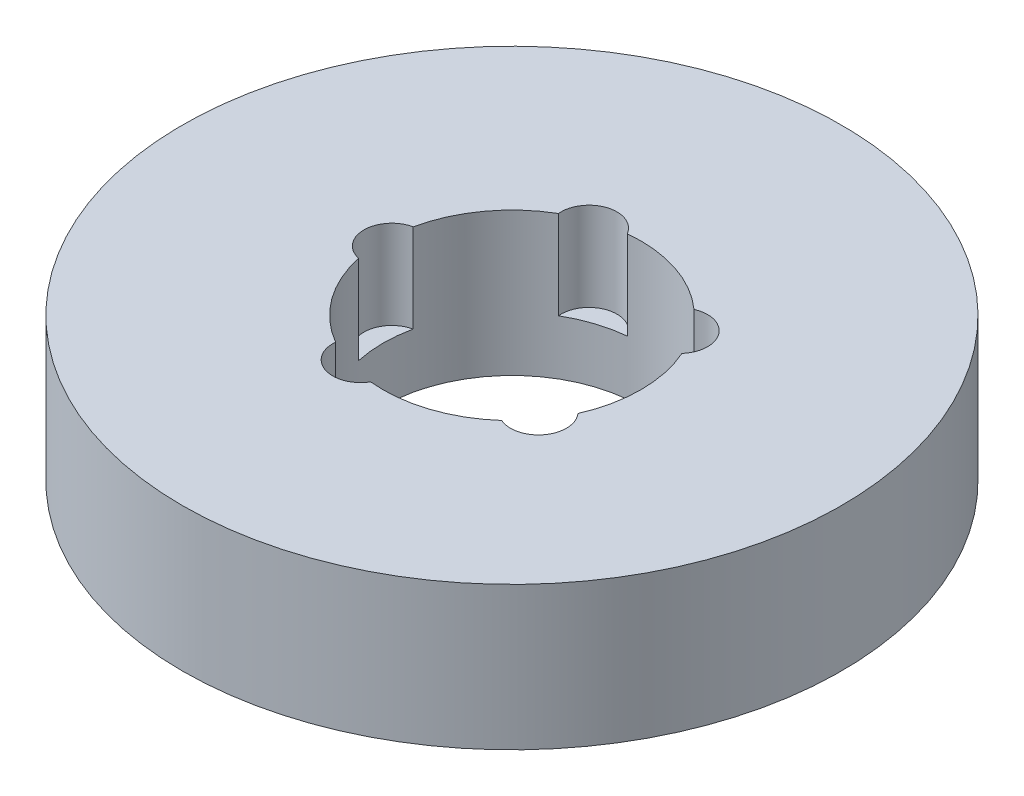
ISO-10303-21;
HEADER;
FILE_DESCRIPTION(('STEP AP214'),'2;1');
FILE_NAME('part.step','',(''),(''),'','','');
FILE_SCHEMA(('AUTOMOTIVE_DESIGN { 1 0 10303 214 1 1 1 1 }'));
ENDSEC;
DATA;
#1=APPLICATION_CONTEXT('core data for automotive mechanical design processes');
#2=APPLICATION_PROTOCOL_DEFINITION('international standard','automotive_design',2000,#1);
#3=PRODUCT_CONTEXT('',#1,'mechanical');
#4=PRODUCT('Part','Part','',(#3));
#5=PRODUCT_RELATED_PRODUCT_CATEGORY('part','',(#4));
#6=PRODUCT_DEFINITION_FORMATION('','',#4);
#7=PRODUCT_DEFINITION_CONTEXT('part definition',#1,'design');
#8=PRODUCT_DEFINITION('design','',#6,#7);
#9=PRODUCT_DEFINITION_SHAPE('','',#8);
#10=(LENGTH_UNIT() NAMED_UNIT(*) SI_UNIT(.MILLI.,.METRE.));
#11=(NAMED_UNIT(*) PLANE_ANGLE_UNIT() SI_UNIT($,.RADIAN.));
#12=(NAMED_UNIT(*) SI_UNIT($,.STERADIAN.) SOLID_ANGLE_UNIT());
#13=UNCERTAINTY_MEASURE_WITH_UNIT(LENGTH_MEASURE(1.E-05),#10,'distance_accuracy_value','');
#14=(GEOMETRIC_REPRESENTATION_CONTEXT(3) GLOBAL_UNCERTAINTY_ASSIGNED_CONTEXT((#13)) GLOBAL_UNIT_ASSIGNED_CONTEXT((#10,
#11,#12)) REPRESENTATION_CONTEXT('',''));
#15=CARTESIAN_POINT('',(0.,0.,0.));
#16=DIRECTION('',(0.,0.,1.));
#17=DIRECTION('',(1.,0.,0.));
#18=AXIS2_PLACEMENT_3D('',#15,#16,#17);
#19=CARTESIAN_POINT('',(0.,25.,0.));
#20=DIRECTION('',(0.,-1.,0.));
#21=DIRECTION('',(0.,0.,-1.));
#22=AXIS2_PLACEMENT_3D('',#19,#20,#21);
#23=CYLINDRICAL_SURFACE('',#22,57.5);
#24=CARTESIAN_POINT('',(0.,25.,0.));
#25=DIRECTION('',(0.,1.,0.));
#26=DIRECTION('',(0.,0.,1.));
#27=AXIS2_PLACEMENT_3D('',#24,#25,#26);
#28=CIRCLE('',#27,57.5);
#29=CARTESIAN_POINT('',(0.,25.,57.5));
#30=VERTEX_POINT('',#29);
#31=EDGE_CURVE('E151',#30,#30,#28,.T.);
#32=ORIENTED_EDGE('',*,*,#31,.F.);
#33=EDGE_LOOP('',(#32));
#34=FACE_BOUND('',#33,.T.);
#35=CARTESIAN_POINT('',(0.,0.,0.));
#36=DIRECTION('',(0.,1.,0.));
#37=DIRECTION('',(0.,0.,1.));
#38=AXIS2_PLACEMENT_3D('',#35,#36,#37);
#39=CIRCLE('',#38,57.5);
#40=CARTESIAN_POINT('',(0.,0.,57.5));
#41=VERTEX_POINT('',#40);
#42=EDGE_CURVE('E150',#41,#41,#39,.T.);
#43=ORIENTED_EDGE('',*,*,#42,.T.);
#44=EDGE_LOOP('',(#43));
#45=FACE_BOUND('',#44,.T.);
#46=ADVANCED_FACE('F39',(#34,#45),#23,.T.);
#47=CARTESIAN_POINT('',(0.,25.,0.));
#48=DIRECTION('',(0.,1.,0.));
#49=DIRECTION('',(0.,0.,1.));
#50=AXIS2_PLACEMENT_3D('',#47,#48,#49);
#51=PLANE('',#50);
#52=CARTESIAN_POINT('',(-6.47333181664618,25.,-19.9228667627639));
#53=DIRECTION('',(0.,1.,0.));
#54=DIRECTION('',(-0.95105651629515,0.,0.309016994374958));
#55=AXIS2_PLACEMENT_3D('',#52,#53,#54);
#56=CIRCLE('',#55,4.87550863720851);
#57=CARTESIAN_POINT('',(-2.26556569637546,25.,-22.3856474571411));
#58=VERTEX_POINT('',#57);
#59=CARTESIAN_POINT('',(-11.3250722880858,25.,-19.4420353273424));
#60=VERTEX_POINT('',#59);
#61=EDGE_CURVE('E196',#58,#60,#56,.T.);
#62=ORIENTED_EDGE('',*,*,#61,.F.);
#63=CARTESIAN_POINT('',(0.,25.,0.));
#64=DIRECTION('',(0.,1.,0.));
#65=DIRECTION('',(0.,0.,1.));
#66=AXIS2_PLACEMENT_3D('',#63,#64,#65);
#67=CIRCLE('',#66,22.5);
#68=CARTESIAN_POINT('',(14.9908345885664,25.,-16.7787031184845));
#69=VERTEX_POINT('',#68);
#70=EDGE_CURVE('E156',#69,#58,#67,.T.);
#71=ORIENTED_EDGE('',*,*,#70,.F.);
#72=CARTESIAN_POINT('',(16.9474027164351,25.,-12.3130088127239));
#73=DIRECTION('',(0.,1.,0.));
#74=DIRECTION('',(-0.58778525229248,0.,-0.809016994374942));
#75=AXIS2_PLACEMENT_3D('',#72,#73,#74);
#76=CIRCLE('',#75,4.87550863720851);
#77=CARTESIAN_POINT('',(20.5899175835472,25.,-9.07222651297552));
#78=VERTEX_POINT('',#77);
#79=EDGE_CURVE('E254',#78,#69,#76,.T.);
#80=ORIENTED_EDGE('',*,*,#79,.F.);
#81=CARTESIAN_POINT('',(20.5899175835473,25.,9.07222651297522));
#82=VERTEX_POINT('',#81);
#83=EDGE_CURVE('E153',#82,#78,#67,.T.);
#84=ORIENTED_EDGE('',*,*,#83,.F.);
#85=CARTESIAN_POINT('',(16.9474027164353,25.,12.3130088127237));
#86=DIRECTION('',(0.,1.,0.));
#87=DIRECTION('',(0.587785252292469,0.,-0.809016994374951));
#88=AXIS2_PLACEMENT_3D('',#85,#86,#87);
#89=CIRCLE('',#88,4.87550863720851);
#90=CARTESIAN_POINT('',(14.9908345885666,25.,16.7787031184843));
#91=VERTEX_POINT('',#90);
#92=EDGE_CURVE('E248',#91,#82,#89,.T.);
#93=ORIENTED_EDGE('',*,*,#92,.F.);
#94=CARTESIAN_POINT('',(-2.26556569637514,25.,22.3856474571411));
#95=VERTEX_POINT('',#94);
#96=EDGE_CURVE('E140',#95,#91,#67,.T.);
#97=ORIENTED_EDGE('',*,*,#96,.F.);
#98=CARTESIAN_POINT('',(-6.4733318166459,25.,19.922866762764));
#99=DIRECTION('',(0.,1.,0.));
#100=DIRECTION('',(0.951056516295155,0.,0.309016994374945));
#101=AXIS2_PLACEMENT_3D('',#98,#99,#100);
#102=CIRCLE('',#101,4.87550863720851);
#103=CARTESIAN_POINT('',(-11.3250722880855,25.,19.4420353273426));
#104=VERTEX_POINT('',#103);
#105=EDGE_CURVE('E117',#104,#95,#102,.T.);
#106=ORIENTED_EDGE('',*,*,#105,.F.);
#107=CARTESIAN_POINT('',(-21.9901141876529,25.,4.76286447571053));
#108=VERTEX_POINT('',#107);
#109=EDGE_CURVE('E133',#108,#104,#67,.T.);
#110=ORIENTED_EDGE('',*,*,#109,.F.);
#111=CARTESIAN_POINT('',(-20.9481417995785,25.,0.));
#112=DIRECTION('',(0.,1.,0.));
#113=DIRECTION('',(0.,0.,1.));
#114=AXIS2_PLACEMENT_3D('',#111,#112,#113);
#115=CIRCLE('',#114,4.87550863720851);
#116=CARTESIAN_POINT('',(-21.9901141876529,25.,-4.76286447571053));
#117=VERTEX_POINT('',#116);
#118=EDGE_CURVE('E170',#117,#108,#115,.T.);
#119=ORIENTED_EDGE('',*,*,#118,.F.);
#120=EDGE_CURVE('E149',#60,#117,#67,.T.);
#121=ORIENTED_EDGE('',*,*,#120,.F.);
#122=EDGE_LOOP('',(#62,#71,#80,#84,#93,#97,#106,#110,#119,#121));
#123=FACE_BOUND('',#122,.T.);
#124=ORIENTED_EDGE('',*,*,#31,.T.);
#125=EDGE_LOOP('',(#124));
#126=FACE_BOUND('',#125,.T.);
#127=ADVANCED_FACE('F131',(#123,#126),#51,.T.);
#128=CARTESIAN_POINT('',(0.,0.,0.));
#129=DIRECTION('',(0.,1.,0.));
#130=DIRECTION('',(0.,0.,1.));
#131=AXIS2_PLACEMENT_3D('',#128,#129,#130);
#132=PLANE('',#131);
#133=CARTESIAN_POINT('',(0.,0.,0.));
#134=DIRECTION('',(0.,1.,0.));
#135=DIRECTION('',(0.,0.,1.));
#136=AXIS2_PLACEMENT_3D('',#133,#134,#135);
#137=CIRCLE('',#136,22.5);
#138=CARTESIAN_POINT('',(0.,0.,22.5));
#139=VERTEX_POINT('',#138);
#140=EDGE_CURVE('E160',#139,#139,#137,.T.);
#141=ORIENTED_EDGE('',*,*,#140,.T.);
#142=EDGE_LOOP('',(#141));
#143=FACE_BOUND('',#142,.T.);
#144=ORIENTED_EDGE('',*,*,#42,.F.);
#145=EDGE_LOOP('',(#144));
#146=FACE_BOUND('',#145,.T.);
#147=ADVANCED_FACE('F212',(#143,#146),#132,.F.);
#148=CARTESIAN_POINT('',(0.,25.,0.));
#149=DIRECTION('',(0.,-1.,0.));
#150=DIRECTION('',(0.,0.,-1.));
#151=AXIS2_PLACEMENT_3D('',#148,#149,#150);
#152=CYLINDRICAL_SURFACE('',#151,22.5);
#153=DIRECTION('',(0.,1.,0.));
#154=VECTOR('',#153,1.);
#155=CARTESIAN_POINT('',(-2.26556569637546,17.2726227905955,-22.3856474571411));
#156=LINE('',#155,#154);
#157=CARTESIAN_POINT('',(-2.26556569637546,9.54524558119105,-22.3856474571411));
#158=VERTEX_POINT('',#157);
#159=EDGE_CURVE('E11',#158,#58,#156,.T.);
#160=ORIENTED_EDGE('',*,*,#159,.F.);
#161=CARTESIAN_POINT('',(0.,9.54524558119105,0.));
#162=DIRECTION('',(0.,1.,0.));
#163=DIRECTION('',(0.,0.,1.));
#164=AXIS2_PLACEMENT_3D('',#161,#162,#163);
#165=CIRCLE('',#164,22.5);
#166=CARTESIAN_POINT('',(-11.3250722880858,9.54524558119105,-19.4420353273424));
#167=VERTEX_POINT('',#166);
#168=EDGE_CURVE('E193',#158,#167,#165,.T.);
#169=ORIENTED_EDGE('',*,*,#168,.T.);
#170=DIRECTION('',(0.,1.,0.));
#171=VECTOR('',#170,1.);
#172=CARTESIAN_POINT('',(-11.3250722880858,17.2726227905955,-19.4420353273424));
#173=LINE('',#172,#171);
#174=EDGE_CURVE('E46',#60,#167,#173,.F.);
#175=ORIENTED_EDGE('',*,*,#174,.F.);
#176=ORIENTED_EDGE('',*,*,#120,.T.);
#177=DIRECTION('',(0.,1.,0.));
#178=VECTOR('',#177,1.);
#179=CARTESIAN_POINT('',(-21.9901141876529,17.2726227905955,-4.76286447571052));
#180=LINE('',#179,#178);
#181=CARTESIAN_POINT('',(-21.9901141876529,9.54524558119105,-4.76286447571053));
#182=VERTEX_POINT('',#181);
#183=EDGE_CURVE('E174',#182,#117,#180,.T.);
#184=ORIENTED_EDGE('',*,*,#183,.F.);
#185=CARTESIAN_POINT('',(0.,9.54524558119105,0.));
#186=DIRECTION('',(0.,1.,0.));
#187=DIRECTION('',(0.,0.,1.));
#188=AXIS2_PLACEMENT_3D('',#185,#186,#187);
#189=CIRCLE('',#188,22.5);
#190=CARTESIAN_POINT('',(-21.9901141876529,9.54524558119105,4.76286447571053));
#191=VERTEX_POINT('',#190);
#192=EDGE_CURVE('E171',#182,#191,#189,.T.);
#193=ORIENTED_EDGE('',*,*,#192,.T.);
#194=DIRECTION('',(0.,1.,0.));
#195=VECTOR('',#194,1.);
#196=CARTESIAN_POINT('',(-21.9901141876529,17.2726227905955,4.76286447571052));
#197=LINE('',#196,#195);
#198=EDGE_CURVE('E148',#108,#191,#197,.F.);
#199=ORIENTED_EDGE('',*,*,#198,.F.);
#200=ORIENTED_EDGE('',*,*,#109,.T.);
#201=DIRECTION('',(0.,1.,0.));
#202=VECTOR('',#201,1.);
#203=CARTESIAN_POINT('',(-11.3250722880855,17.2726227905955,19.4420353273426));
#204=LINE('',#203,#202);
#205=CARTESIAN_POINT('',(-11.3250722880855,9.54524558119105,19.4420353273426));
#206=VERTEX_POINT('',#205);
#207=EDGE_CURVE('E111',#206,#104,#204,.T.);
#208=ORIENTED_EDGE('',*,*,#207,.F.);
#209=CARTESIAN_POINT('',(0.,9.54524558119105,0.));
#210=DIRECTION('',(0.,1.,0.));
#211=DIRECTION('',(0.,0.,1.));
#212=AXIS2_PLACEMENT_3D('',#209,#210,#211);
#213=CIRCLE('',#212,22.5);
#214=CARTESIAN_POINT('',(-2.26556569637514,9.54524558119105,22.3856474571411));
#215=VERTEX_POINT('',#214);
#216=EDGE_CURVE('E180',#206,#215,#213,.T.);
#217=ORIENTED_EDGE('',*,*,#216,.T.);
#218=DIRECTION('',(0.,1.,0.));
#219=VECTOR('',#218,1.);
#220=CARTESIAN_POINT('',(-2.26556569637514,17.2726227905955,22.3856474571411));
#221=LINE('',#220,#219);
#222=EDGE_CURVE('E124',#95,#215,#221,.F.);
#223=ORIENTED_EDGE('',*,*,#222,.F.);
#224=ORIENTED_EDGE('',*,*,#96,.T.);
#225=DIRECTION('',(0.,1.,0.));
#226=VECTOR('',#225,1.);
#227=CARTESIAN_POINT('',(14.9908345885666,17.2726227905955,16.7787031184843));
#228=LINE('',#227,#226);
#229=CARTESIAN_POINT('',(14.9908345885666,9.54524558119105,16.7787031184843));
#230=VERTEX_POINT('',#229);
#231=EDGE_CURVE('E183',#230,#91,#228,.T.);
#232=ORIENTED_EDGE('',*,*,#231,.F.);
#233=CARTESIAN_POINT('',(0.,9.54524558119105,0.));
#234=DIRECTION('',(0.,1.,0.));
#235=DIRECTION('',(0.,0.,1.));
#236=AXIS2_PLACEMENT_3D('',#233,#234,#235);
#237=CIRCLE('',#236,22.5);
#238=CARTESIAN_POINT('',(20.5899175835473,9.54524558119105,9.07222651297522));
#239=VERTEX_POINT('',#238);
#240=EDGE_CURVE('E123',#230,#239,#237,.T.);
#241=ORIENTED_EDGE('',*,*,#240,.T.);
#242=DIRECTION('',(0.,1.,0.));
#243=VECTOR('',#242,1.);
#244=CARTESIAN_POINT('',(20.5899175835473,17.2726227905955,9.07222651297522));
#245=LINE('',#244,#243);
#246=EDGE_CURVE('E185',#82,#239,#245,.F.);
#247=ORIENTED_EDGE('',*,*,#246,.F.);
#248=ORIENTED_EDGE('',*,*,#83,.T.);
#249=DIRECTION('',(0.,1.,0.));
#250=VECTOR('',#249,1.);
#251=CARTESIAN_POINT('',(20.5899175835472,17.2726227905955,-9.07222651297551));
#252=LINE('',#251,#250);
#253=CARTESIAN_POINT('',(20.5899175835472,9.54524558119105,-9.07222651297552));
#254=VERTEX_POINT('',#253);
#255=EDGE_CURVE('E195',#254,#78,#252,.T.);
#256=ORIENTED_EDGE('',*,*,#255,.F.);
#257=CARTESIAN_POINT('',(0.,9.54524558119105,0.));
#258=DIRECTION('',(0.,1.,0.));
#259=DIRECTION('',(0.,0.,1.));
#260=AXIS2_PLACEMENT_3D('',#257,#258,#259);
#261=CIRCLE('',#260,22.5);
#262=CARTESIAN_POINT('',(14.9908345885664,9.54524558119105,-16.7787031184845));
#263=VERTEX_POINT('',#262);
#264=EDGE_CURVE('E190',#254,#263,#261,.T.);
#265=ORIENTED_EDGE('',*,*,#264,.T.);
#266=DIRECTION('',(0.,1.,0.));
#267=VECTOR('',#266,1.);
#268=CARTESIAN_POINT('',(14.9908345885663,17.2726227905955,-16.7787031184845));
#269=LINE('',#268,#267);
#270=EDGE_CURVE('E189',#69,#263,#269,.F.);
#271=ORIENTED_EDGE('',*,*,#270,.F.);
#272=ORIENTED_EDGE('',*,*,#70,.T.);
#273=EDGE_LOOP('',(#160,#169,#175,#176,#184,#193,#199,#200,#208,#217,#223,#224,#232,#241,#247,
#248,#256,#265,#271,#272));
#274=FACE_BOUND('',#273,.T.);
#275=ORIENTED_EDGE('',*,*,#140,.F.);
#276=EDGE_LOOP('',(#275));
#277=FACE_BOUND('',#276,.T.);
#278=ADVANCED_FACE('F142',(#274,#277),#152,.F.);
#279=CARTESIAN_POINT('',(-20.9481417995785,9.54524558119105,0.));
#280=DIRECTION('',(0.,1.,0.));
#281=DIRECTION('',(0.,0.,1.));
#282=AXIS2_PLACEMENT_3D('',#279,#280,#281);
#283=CYLINDRICAL_SURFACE('',#282,4.87550863720851);
#284=ORIENTED_EDGE('',*,*,#183,.T.);
#285=ORIENTED_EDGE('',*,*,#118,.T.);
#286=ORIENTED_EDGE('',*,*,#198,.T.);
#287=CARTESIAN_POINT('',(-20.9481417995785,9.54524558119105,0.));
#288=DIRECTION('',(0.,1.,0.));
#289=DIRECTION('',(0.,0.,1.));
#290=AXIS2_PLACEMENT_3D('',#287,#288,#289);
#291=CIRCLE('',#290,4.87550863720851);
#292=EDGE_CURVE('E163',#182,#191,#291,.T.);
#293=ORIENTED_EDGE('',*,*,#292,.F.);
#294=EDGE_LOOP('',(#284,#285,#286,#293));
#295=FACE_BOUND('',#294,.T.);
#296=ADVANCED_FACE('F221',(#295),#283,.F.);
#297=CARTESIAN_POINT('',(-20.9481417995785,9.54524558119105,0.));
#298=DIRECTION('',(0.,1.,0.));
#299=DIRECTION('',(0.,0.,1.));
#300=AXIS2_PLACEMENT_3D('',#297,#298,#299);
#301=PLANE('',#300);
#302=ORIENTED_EDGE('',*,*,#292,.T.);
#303=ORIENTED_EDGE('',*,*,#192,.F.);
#304=EDGE_LOOP('',(#302,#303));
#305=FACE_BOUND('',#304,.T.);
#306=ADVANCED_FACE('F227',(#305),#301,.T.);
#307=CARTESIAN_POINT('',(-6.4733318166459,9.54524558119105,19.922866762764));
#308=DIRECTION('',(0.,1.,0.));
#309=DIRECTION('',(0.,0.,1.));
#310=AXIS2_PLACEMENT_3D('',#307,#308,#309);
#311=CYLINDRICAL_SURFACE('',#310,4.87550863720851);
#312=ORIENTED_EDGE('',*,*,#207,.T.);
#313=ORIENTED_EDGE('',*,*,#105,.T.);
#314=ORIENTED_EDGE('',*,*,#222,.T.);
#315=CARTESIAN_POINT('',(-6.4733318166459,9.54524558119105,19.922866762764));
#316=DIRECTION('',(0.,1.,0.));
#317=DIRECTION('',(0.951056516295155,0.,0.309016994374945));
#318=AXIS2_PLACEMENT_3D('',#315,#316,#317);
#319=CIRCLE('',#318,4.87550863720851);
#320=EDGE_CURVE('E119',#206,#215,#319,.T.);
#321=ORIENTED_EDGE('',*,*,#320,.F.);
#322=EDGE_LOOP('',(#312,#313,#314,#321));
#323=FACE_BOUND('',#322,.T.);
#324=ADVANCED_FACE('F116',(#323),#311,.F.);
#325=CARTESIAN_POINT('',(-6.4733318166459,9.54524558119105,19.922866762764));
#326=DIRECTION('',(0.,1.,0.));
#327=DIRECTION('',(0.951056516295155,0.,0.309016994374945));
#328=AXIS2_PLACEMENT_3D('',#325,#326,#327);
#329=PLANE('',#328);
#330=ORIENTED_EDGE('',*,*,#320,.T.);
#331=ORIENTED_EDGE('',*,*,#216,.F.);
#332=EDGE_LOOP('',(#330,#331));
#333=FACE_BOUND('',#332,.T.);
#334=ADVANCED_FACE('F234',(#333),#329,.T.);
#335=CARTESIAN_POINT('',(16.9474027164353,9.54524558119105,12.3130088127237));
#336=DIRECTION('',(0.,1.,0.));
#337=DIRECTION('',(0.,0.,1.));
#338=AXIS2_PLACEMENT_3D('',#335,#336,#337);
#339=CYLINDRICAL_SURFACE('',#338,4.87550863720851);
#340=ORIENTED_EDGE('',*,*,#231,.T.);
#341=ORIENTED_EDGE('',*,*,#92,.T.);
#342=ORIENTED_EDGE('',*,*,#246,.T.);
#343=CARTESIAN_POINT('',(16.9474027164353,9.54524558119105,12.3130088127237));
#344=DIRECTION('',(0.,1.,0.));
#345=DIRECTION('',(0.587785252292469,0.,-0.809016994374951));
#346=AXIS2_PLACEMENT_3D('',#343,#344,#345);
#347=CIRCLE('',#346,4.87550863720851);
#348=EDGE_CURVE('E137',#230,#239,#347,.T.);
#349=ORIENTED_EDGE('',*,*,#348,.F.);
#350=EDGE_LOOP('',(#340,#341,#342,#349));
#351=FACE_BOUND('',#350,.T.);
#352=ADVANCED_FACE('F240',(#351),#339,.F.);
#353=CARTESIAN_POINT('',(16.9474027164353,9.54524558119105,12.3130088127237));
#354=DIRECTION('',(0.,1.,0.));
#355=DIRECTION('',(0.587785252292469,0.,-0.809016994374951));
#356=AXIS2_PLACEMENT_3D('',#353,#354,#355);
#357=PLANE('',#356);
#358=ORIENTED_EDGE('',*,*,#348,.T.);
#359=ORIENTED_EDGE('',*,*,#240,.F.);
#360=EDGE_LOOP('',(#358,#359));
#361=FACE_BOUND('',#360,.T.);
#362=ADVANCED_FACE('F245',(#361),#357,.T.);
#363=CARTESIAN_POINT('',(16.9474027164351,9.54524558119105,-12.3130088127239));
#364=DIRECTION('',(0.,1.,0.));
#365=DIRECTION('',(0.,0.,1.));
#366=AXIS2_PLACEMENT_3D('',#363,#364,#365);
#367=CYLINDRICAL_SURFACE('',#366,4.87550863720851);
#368=ORIENTED_EDGE('',*,*,#255,.T.);
#369=ORIENTED_EDGE('',*,*,#79,.T.);
#370=ORIENTED_EDGE('',*,*,#270,.T.);
#371=CARTESIAN_POINT('',(16.9474027164351,9.54524558119105,-12.3130088127239));
#372=DIRECTION('',(0.,1.,0.));
#373=DIRECTION('',(-0.58778525229248,0.,-0.809016994374942));
#374=AXIS2_PLACEMENT_3D('',#371,#372,#373);
#375=CIRCLE('',#374,4.87550863720851);
#376=EDGE_CURVE('E56',#254,#263,#375,.T.);
#377=ORIENTED_EDGE('',*,*,#376,.F.);
#378=EDGE_LOOP('',(#368,#369,#370,#377));
#379=FACE_BOUND('',#378,.T.);
#380=ADVANCED_FACE('F264',(#379),#367,.F.);
#381=CARTESIAN_POINT('',(16.9474027164351,9.54524558119105,-12.3130088127239));
#382=DIRECTION('',(0.,1.,0.));
#383=DIRECTION('',(-0.58778525229248,0.,-0.809016994374942));
#384=AXIS2_PLACEMENT_3D('',#381,#382,#383);
#385=PLANE('',#384);
#386=ORIENTED_EDGE('',*,*,#376,.T.);
#387=ORIENTED_EDGE('',*,*,#264,.F.);
#388=EDGE_LOOP('',(#386,#387));
#389=FACE_BOUND('',#388,.T.);
#390=ADVANCED_FACE('F202',(#389),#385,.T.);
#391=CARTESIAN_POINT('',(-6.47333181664618,9.54524558119105,-19.9228667627639));
#392=DIRECTION('',(0.,1.,0.));
#393=DIRECTION('',(0.,0.,1.));
#394=AXIS2_PLACEMENT_3D('',#391,#392,#393);
#395=CYLINDRICAL_SURFACE('',#394,4.87550863720851);
#396=ORIENTED_EDGE('',*,*,#159,.T.);
#397=ORIENTED_EDGE('',*,*,#61,.T.);
#398=ORIENTED_EDGE('',*,*,#174,.T.);
#399=CARTESIAN_POINT('',(-6.47333181664618,9.54524558119105,-19.9228667627639));
#400=DIRECTION('',(0.,1.,0.));
#401=DIRECTION('',(-0.95105651629515,0.,0.309016994374958));
#402=AXIS2_PLACEMENT_3D('',#399,#400,#401);
#403=CIRCLE('',#402,4.87550863720851);
#404=EDGE_CURVE('E55',#158,#167,#403,.T.);
#405=ORIENTED_EDGE('',*,*,#404,.F.);
#406=EDGE_LOOP('',(#396,#397,#398,#405));
#407=FACE_BOUND('',#406,.T.);
#408=ADVANCED_FACE('F197',(#407),#395,.F.);
#409=CARTESIAN_POINT('',(-6.47333181664618,9.54524558119105,-19.9228667627639));
#410=DIRECTION('',(0.,1.,0.));
#411=DIRECTION('',(-0.95105651629515,0.,0.309016994374958));
#412=AXIS2_PLACEMENT_3D('',#409,#410,#411);
#413=PLANE('',#412);
#414=ORIENTED_EDGE('',*,*,#404,.T.);
#415=ORIENTED_EDGE('',*,*,#168,.F.);
#416=EDGE_LOOP('',(#414,#415));
#417=FACE_BOUND('',#416,.T.);
#418=ADVANCED_FACE('F200',(#417),#413,.T.);
#419=CLOSED_SHELL('',(#46,#127,#147,#278,#296,#306,#324,#334,#352,#362,#380,#390,#408,#418));
#420=MANIFOLD_SOLID_BREP('B2',#419);
#421=ADVANCED_BREP_SHAPE_REPRESENTATION('',(#18,#420),#14);
#422=SHAPE_DEFINITION_REPRESENTATION(#9,#421);
ENDSEC;
END-ISO-10303-21;
